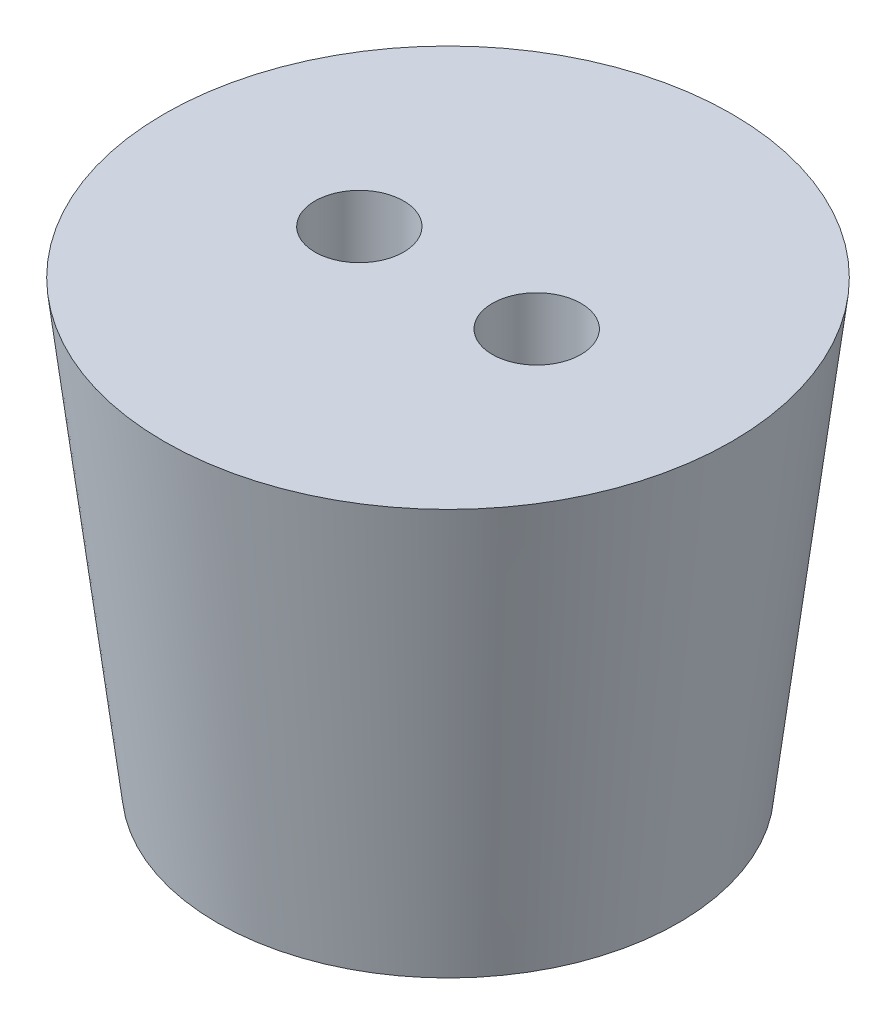
ISO-10303-21;
HEADER;
FILE_DESCRIPTION(('STEP AP214'),'2;1');
FILE_NAME('part.step','',(''),(''),'','','');
FILE_SCHEMA(('AUTOMOTIVE_DESIGN { 1 0 10303 214 1 1 1 1 }'));
ENDSEC;
DATA;
#1=APPLICATION_CONTEXT('core data for automotive mechanical design processes');
#2=APPLICATION_PROTOCOL_DEFINITION('international standard','automotive_design',2000,#1);
#3=PRODUCT_CONTEXT('',#1,'mechanical');
#4=PRODUCT('Part','Part','',(#3));
#5=PRODUCT_RELATED_PRODUCT_CATEGORY('part','',(#4));
#6=PRODUCT_DEFINITION_FORMATION('','',#4);
#7=PRODUCT_DEFINITION_CONTEXT('part definition',#1,'design');
#8=PRODUCT_DEFINITION('design','',#6,#7);
#9=PRODUCT_DEFINITION_SHAPE('','',#8);
#10=(LENGTH_UNIT() NAMED_UNIT(*) SI_UNIT(.MILLI.,.METRE.));
#11=(NAMED_UNIT(*) PLANE_ANGLE_UNIT() SI_UNIT($,.RADIAN.));
#12=(NAMED_UNIT(*) SI_UNIT($,.STERADIAN.) SOLID_ANGLE_UNIT());
#13=UNCERTAINTY_MEASURE_WITH_UNIT(LENGTH_MEASURE(1.E-05),#10,'distance_accuracy_value','');
#14=(GEOMETRIC_REPRESENTATION_CONTEXT(3) GLOBAL_UNCERTAINTY_ASSIGNED_CONTEXT((#13)) GLOBAL_UNIT_ASSIGNED_CONTEXT((#10,
#11,#12)) REPRESENTATION_CONTEXT('',''));
#15=CARTESIAN_POINT('',(0.,0.,0.));
#16=DIRECTION('',(0.,0.,1.));
#17=DIRECTION('',(1.,0.,0.));
#18=AXIS2_PLACEMENT_3D('',#15,#16,#17);
#19=CARTESIAN_POINT('',(0.,0.,0.));
#20=DIRECTION('',(0.,1.,0.));
#21=DIRECTION('',(0.,0.,1.));
#22=AXIS2_PLACEMENT_3D('',#19,#20,#21);
#23=CONICAL_SURFACE('',#22,13.,0.119428926018339);
#24=CARTESIAN_POINT('',(0.,0.,0.));
#25=DIRECTION('',(0.,-1.,0.));
#26=DIRECTION('',(0.,0.,1.));
#27=AXIS2_PLACEMENT_3D('',#24,#25,#26);
#28=CIRCLE('',#27,13.);
#29=CARTESIAN_POINT('',(0.,0.,13.));
#30=VERTEX_POINT('',#29);
#31=EDGE_CURVE('E11',#30,#30,#28,.F.);
#32=ORIENTED_EDGE('',*,*,#31,.T.);
#33=EDGE_LOOP('',(#32));
#34=FACE_BOUND('',#33,.T.);
#35=CARTESIAN_POINT('',(0.,25.,-1.74574066942157E-13));
#36=DIRECTION('',(0.,1.,0.));
#37=DIRECTION('',(0.,0.,1.));
#38=AXIS2_PLACEMENT_3D('',#35,#36,#37);
#39=CIRCLE('',#38,16.);
#40=CARTESIAN_POINT('',(0.,25.0000000000001,15.9999999999998));
#41=VERTEX_POINT('',#40);
#42=EDGE_CURVE('E66',#41,#41,#39,.T.);
#43=ORIENTED_EDGE('',*,*,#42,.F.);
#44=EDGE_LOOP('',(#43));
#45=FACE_BOUND('',#44,.T.);
#46=ADVANCED_FACE('F58',(#34,#45),#23,.T.);
#47=CARTESIAN_POINT('',(0.,0.,0.));
#48=DIRECTION('',(0.,1.,0.));
#49=DIRECTION('',(0.,0.,1.));
#50=AXIS2_PLACEMENT_3D('',#47,#48,#49);
#51=PLANE('',#50);
#52=CARTESIAN_POINT('',(-5.,0.,0.));
#53=DIRECTION('',(0.,-1.,0.));
#54=DIRECTION('',(0.,0.,1.));
#55=AXIS2_PLACEMENT_3D('',#52,#53,#54);
#56=CIRCLE('',#55,2.5);
#57=CARTESIAN_POINT('',(-5.,0.,2.5));
#58=VERTEX_POINT('',#57);
#59=EDGE_CURVE('E80',#58,#58,#56,.T.);
#60=ORIENTED_EDGE('',*,*,#59,.F.);
#61=EDGE_LOOP('',(#60));
#62=FACE_BOUND('',#61,.T.);
#63=CARTESIAN_POINT('',(5.,0.,0.));
#64=DIRECTION('',(0.,-1.,0.));
#65=DIRECTION('',(0.,0.,-1.));
#66=AXIS2_PLACEMENT_3D('',#63,#64,#65);
#67=CIRCLE('',#66,2.5);
#68=CARTESIAN_POINT('',(5.,0.,-2.5));
#69=VERTEX_POINT('',#68);
#70=EDGE_CURVE('E79',#69,#69,#67,.T.);
#71=ORIENTED_EDGE('',*,*,#70,.F.);
#72=EDGE_LOOP('',(#71));
#73=FACE_BOUND('',#72,.T.);
#74=ORIENTED_EDGE('',*,*,#31,.F.);
#75=EDGE_LOOP('',(#74));
#76=FACE_BOUND('',#75,.T.);
#77=ADVANCED_FACE('F108',(#62,#73,#76),#51,.F.);
#78=CARTESIAN_POINT('',(0.,25.,-1.74574066942157E-13));
#79=DIRECTION('',(0.,1.,0.));
#80=DIRECTION('',(0.,0.,1.));
#81=AXIS2_PLACEMENT_3D('',#78,#79,#80);
#82=PLANE('',#81);
#83=CARTESIAN_POINT('',(-5.,25.,0.));
#84=DIRECTION('',(0.,1.,0.));
#85=DIRECTION('',(0.,0.,1.));
#86=AXIS2_PLACEMENT_3D('',#83,#84,#85);
#87=CIRCLE('',#86,2.5);
#88=CARTESIAN_POINT('',(-5.,25.,2.5));
#89=VERTEX_POINT('',#88);
#90=EDGE_CURVE('E75',#89,#89,#87,.T.);
#91=ORIENTED_EDGE('',*,*,#90,.F.);
#92=EDGE_LOOP('',(#91));
#93=FACE_BOUND('',#92,.T.);
#94=CARTESIAN_POINT('',(5.,25.,0.));
#95=DIRECTION('',(0.,1.,0.));
#96=DIRECTION('',(0.,0.,1.));
#97=AXIS2_PLACEMENT_3D('',#94,#95,#96);
#98=CIRCLE('',#97,2.5);
#99=CARTESIAN_POINT('',(5.,25.,2.5));
#100=VERTEX_POINT('',#99);
#101=EDGE_CURVE('E72',#100,#100,#98,.T.);
#102=ORIENTED_EDGE('',*,*,#101,.F.);
#103=EDGE_LOOP('',(#102));
#104=FACE_BOUND('',#103,.T.);
#105=ORIENTED_EDGE('',*,*,#42,.T.);
#106=EDGE_LOOP('',(#105));
#107=FACE_BOUND('',#106,.T.);
#108=ADVANCED_FACE('F98',(#93,#104,#107),#82,.T.);
#109=CARTESIAN_POINT('',(5.,25.0045988291487,0.));
#110=DIRECTION('',(0.,-1.,0.));
#111=DIRECTION('',(0.,0.,-1.));
#112=AXIS2_PLACEMENT_3D('',#109,#110,#111);
#113=CYLINDRICAL_SURFACE('',#112,2.5);
#114=ORIENTED_EDGE('',*,*,#101,.T.);
#115=EDGE_LOOP('',(#114));
#116=FACE_BOUND('',#115,.T.);
#117=ORIENTED_EDGE('',*,*,#70,.T.);
#118=EDGE_LOOP('',(#117));
#119=FACE_BOUND('',#118,.T.);
#120=ADVANCED_FACE('F107',(#116,#119),#113,.F.);
#121=CARTESIAN_POINT('',(-5.,25.0045988291487,0.));
#122=DIRECTION('',(0.,-1.,0.));
#123=DIRECTION('',(0.,0.,-1.));
#124=AXIS2_PLACEMENT_3D('',#121,#122,#123);
#125=CYLINDRICAL_SURFACE('',#124,2.5);
#126=ORIENTED_EDGE('',*,*,#90,.T.);
#127=EDGE_LOOP('',(#126));
#128=FACE_BOUND('',#127,.T.);
#129=ORIENTED_EDGE('',*,*,#59,.T.);
#130=EDGE_LOOP('',(#129));
#131=FACE_BOUND('',#130,.T.);
#132=ADVANCED_FACE('F138',(#128,#131),#125,.F.);
#133=CLOSED_SHELL('',(#46,#77,#108,#120,#132));
#134=MANIFOLD_SOLID_BREP('B2',#133);
#135=ADVANCED_BREP_SHAPE_REPRESENTATION('',(#18,#134),#14);
#136=SHAPE_DEFINITION_REPRESENTATION(#9,#135);
ENDSEC;
END-ISO-10303-21;
